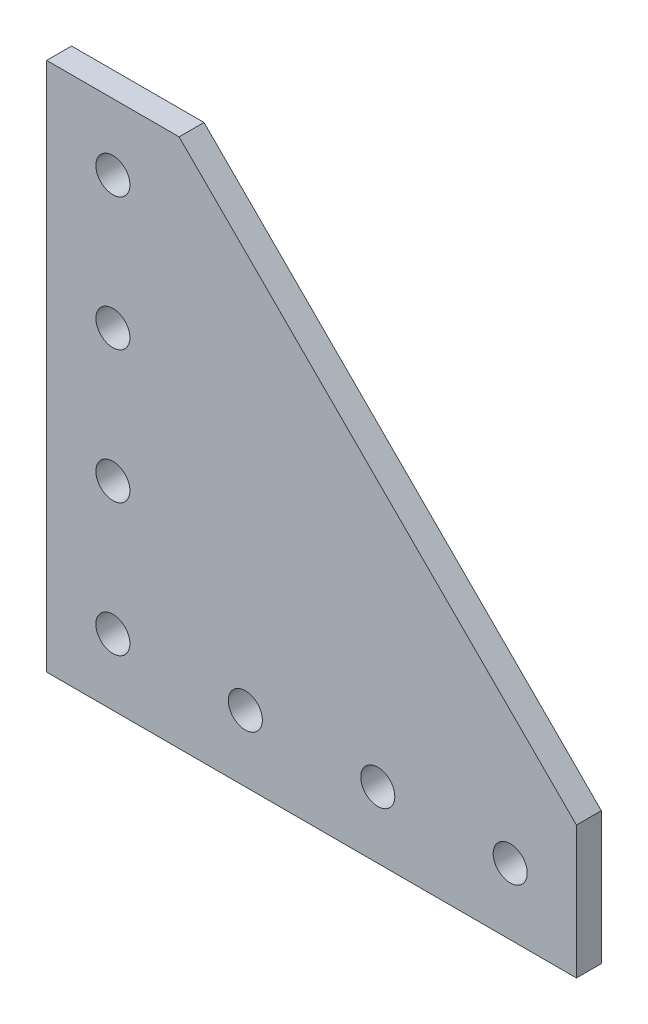
ISO-10303-21;
HEADER;
FILE_DESCRIPTION(('STEP AP214'),'2;1');
FILE_NAME('part.step','',(''),(''),'','','');
FILE_SCHEMA(('AUTOMOTIVE_DESIGN { 1 0 10303 214 1 1 1 1 }'));
ENDSEC;
DATA;
#1=APPLICATION_CONTEXT('core data for automotive mechanical design processes');
#2=APPLICATION_PROTOCOL_DEFINITION('international standard','automotive_design',2000,#1);
#3=PRODUCT_CONTEXT('',#1,'mechanical');
#4=PRODUCT('Part','Part','',(#3));
#5=PRODUCT_RELATED_PRODUCT_CATEGORY('part','',(#4));
#6=PRODUCT_DEFINITION_FORMATION('','',#4);
#7=PRODUCT_DEFINITION_CONTEXT('part definition',#1,'design');
#8=PRODUCT_DEFINITION('design','',#6,#7);
#9=PRODUCT_DEFINITION_SHAPE('','',#8);
#10=(LENGTH_UNIT() NAMED_UNIT(*) SI_UNIT(.MILLI.,.METRE.));
#11=(NAMED_UNIT(*) PLANE_ANGLE_UNIT() SI_UNIT($,.RADIAN.));
#12=(NAMED_UNIT(*) SI_UNIT($,.STERADIAN.) SOLID_ANGLE_UNIT());
#13=UNCERTAINTY_MEASURE_WITH_UNIT(LENGTH_MEASURE(1.E-05),#10,'distance_accuracy_value','');
#14=(GEOMETRIC_REPRESENTATION_CONTEXT(3) GLOBAL_UNCERTAINTY_ASSIGNED_CONTEXT((#13)) GLOBAL_UNIT_ASSIGNED_CONTEXT((#10,
#11,#12)) REPRESENTATION_CONTEXT('',''));
#15=CARTESIAN_POINT('',(0.,0.,0.));
#16=DIRECTION('',(0.,0.,1.));
#17=DIRECTION('',(1.,0.,0.));
#18=AXIS2_PLACEMENT_3D('',#15,#16,#17);
#19=CARTESIAN_POINT('',(-25.4,50.8,-2.3876));
#20=DIRECTION('',(0.707106781186547,0.707106781186547,0.));
#21=DIRECTION('',(-0.707106781186548,0.707106781186548,0.));
#22=AXIS2_PLACEMENT_3D('',#19,#20,#21);
#23=PLANE('',#22);
#24=DIRECTION('',(0.,0.,1.));
#25=VECTOR('',#24,1.);
#26=CARTESIAN_POINT('',(-25.4,50.8,-2.3876));
#27=LINE('',#26,#25);
#28=CARTESIAN_POINT('',(-25.4,50.8,-2.3876));
#29=VERTEX_POINT('',#28);
#30=CARTESIAN_POINT('',(-25.4,50.8,2.3876));
#31=VERTEX_POINT('',#30);
#32=EDGE_CURVE('E35',#29,#31,#27,.T.);
#33=ORIENTED_EDGE('',*,*,#32,.T.);
#34=DIRECTION('',(-0.707106781186548,0.707106781186548,0.));
#35=VECTOR('',#34,1.);
#36=CARTESIAN_POINT('',(-25.4,50.8,2.3876));
#37=LINE('',#36,#35);
#38=CARTESIAN_POINT('',(50.8,-25.4,2.3876));
#39=VERTEX_POINT('',#38);
#40=EDGE_CURVE('E78',#39,#31,#37,.T.);
#41=ORIENTED_EDGE('',*,*,#40,.F.);
#42=DIRECTION('',(0.,0.,1.));
#43=VECTOR('',#42,1.);
#44=CARTESIAN_POINT('',(50.8,-25.4,-2.3876));
#45=LINE('',#44,#43);
#46=CARTESIAN_POINT('',(50.8,-25.4,-2.3876));
#47=VERTEX_POINT('',#46);
#48=EDGE_CURVE('E11',#47,#39,#45,.T.);
#49=ORIENTED_EDGE('',*,*,#48,.F.);
#50=DIRECTION('',(-0.707106781186548,0.707106781186548,0.));
#51=VECTOR('',#50,1.);
#52=CARTESIAN_POINT('',(-25.4,50.8,-2.3876));
#53=LINE('',#52,#51);
#54=EDGE_CURVE('E79',#47,#29,#53,.T.);
#55=ORIENTED_EDGE('',*,*,#54,.T.);
#56=EDGE_LOOP('',(#33,#41,#49,#55));
#57=FACE_BOUND('',#56,.T.);
#58=ADVANCED_FACE('F32',(#57),#23,.T.);
#59=CARTESIAN_POINT('',(50.8,-25.4,-2.3876));
#60=DIRECTION('',(1.,0.,0.));
#61=DIRECTION('',(0.,1.,0.));
#62=AXIS2_PLACEMENT_3D('',#59,#60,#61);
#63=PLANE('',#62);
#64=ORIENTED_EDGE('',*,*,#48,.T.);
#65=DIRECTION('',(0.,1.,0.));
#66=VECTOR('',#65,1.);
#67=CARTESIAN_POINT('',(50.8,-25.4,2.3876));
#68=LINE('',#67,#66);
#69=CARTESIAN_POINT('',(50.8,-50.8,2.3876));
#70=VERTEX_POINT('',#69);
#71=EDGE_CURVE('E96',#70,#39,#68,.T.);
#72=ORIENTED_EDGE('',*,*,#71,.F.);
#73=DIRECTION('',(0.,0.,1.));
#74=VECTOR('',#73,1.);
#75=CARTESIAN_POINT('',(50.8,-50.8,-2.3876));
#76=LINE('',#75,#74);
#77=CARTESIAN_POINT('',(50.8,-50.8,-2.3876));
#78=VERTEX_POINT('',#77);
#79=EDGE_CURVE('E40',#78,#70,#76,.T.);
#80=ORIENTED_EDGE('',*,*,#79,.F.);
#81=DIRECTION('',(0.,1.,0.));
#82=VECTOR('',#81,1.);
#83=CARTESIAN_POINT('',(50.8,-25.4,-2.3876));
#84=LINE('',#83,#82);
#85=EDGE_CURVE('E84',#78,#47,#84,.T.);
#86=ORIENTED_EDGE('',*,*,#85,.T.);
#87=EDGE_LOOP('',(#64,#72,#80,#86));
#88=FACE_BOUND('',#87,.T.);
#89=ADVANCED_FACE('F129',(#88),#63,.T.);
#90=CARTESIAN_POINT('',(50.8,-50.8,-2.3876));
#91=DIRECTION('',(0.,-1.,0.));
#92=DIRECTION('',(0.,0.,-1.));
#93=AXIS2_PLACEMENT_3D('',#90,#91,#92);
#94=PLANE('',#93);
#95=ORIENTED_EDGE('',*,*,#79,.T.);
#96=DIRECTION('',(1.,0.,0.));
#97=VECTOR('',#96,1.);
#98=CARTESIAN_POINT('',(50.8,-50.8,2.3876));
#99=LINE('',#98,#97);
#100=CARTESIAN_POINT('',(-50.8,-50.8,2.3876));
#101=VERTEX_POINT('',#100);
#102=EDGE_CURVE('E105',#101,#70,#99,.T.);
#103=ORIENTED_EDGE('',*,*,#102,.F.);
#104=DIRECTION('',(0.,0.,1.));
#105=VECTOR('',#104,1.);
#106=CARTESIAN_POINT('',(-50.8,-50.8,-2.3876));
#107=LINE('',#106,#105);
#108=CARTESIAN_POINT('',(-50.8,-50.8,-2.3876));
#109=VERTEX_POINT('',#108);
#110=EDGE_CURVE('E118',#109,#101,#107,.T.);
#111=ORIENTED_EDGE('',*,*,#110,.F.);
#112=DIRECTION('',(1.,0.,0.));
#113=VECTOR('',#112,1.);
#114=CARTESIAN_POINT('',(50.8,-50.8,-2.3876));
#115=LINE('',#114,#113);
#116=EDGE_CURVE('E114',#109,#78,#115,.T.);
#117=ORIENTED_EDGE('',*,*,#116,.T.);
#118=EDGE_LOOP('',(#95,#103,#111,#117));
#119=FACE_BOUND('',#118,.T.);
#120=ADVANCED_FACE('F125',(#119),#94,.T.);
#121=CARTESIAN_POINT('',(-50.8,-50.8,-2.3876));
#122=DIRECTION('',(-1.,0.,0.));
#123=DIRECTION('',(0.,-1.,0.));
#124=AXIS2_PLACEMENT_3D('',#121,#122,#123);
#125=PLANE('',#124);
#126=ORIENTED_EDGE('',*,*,#110,.T.);
#127=DIRECTION('',(0.,-1.,0.));
#128=VECTOR('',#127,1.);
#129=CARTESIAN_POINT('',(-50.8,-50.8,2.3876));
#130=LINE('',#129,#128);
#131=CARTESIAN_POINT('',(-50.8,50.8,2.3876));
#132=VERTEX_POINT('',#131);
#133=EDGE_CURVE('E91',#132,#101,#130,.T.);
#134=ORIENTED_EDGE('',*,*,#133,.F.);
#135=DIRECTION('',(0.,0.,1.));
#136=VECTOR('',#135,1.);
#137=CARTESIAN_POINT('',(-50.8,50.8,-2.3876));
#138=LINE('',#137,#136);
#139=CARTESIAN_POINT('',(-50.8,50.8,-2.3876));
#140=VERTEX_POINT('',#139);
#141=EDGE_CURVE('E83',#140,#132,#138,.T.);
#142=ORIENTED_EDGE('',*,*,#141,.F.);
#143=DIRECTION('',(0.,-1.,0.));
#144=VECTOR('',#143,1.);
#145=CARTESIAN_POINT('',(-50.8,-50.8,-2.3876));
#146=LINE('',#145,#144);
#147=EDGE_CURVE('E111',#140,#109,#146,.T.);
#148=ORIENTED_EDGE('',*,*,#147,.T.);
#149=EDGE_LOOP('',(#126,#134,#142,#148));
#150=FACE_BOUND('',#149,.T.);
#151=ADVANCED_FACE('F120',(#150),#125,.T.);
#152=CARTESIAN_POINT('',(-50.8,50.8,-2.3876));
#153=DIRECTION('',(0.,1.,0.));
#154=DIRECTION('',(0.,0.,1.));
#155=AXIS2_PLACEMENT_3D('',#152,#153,#154);
#156=PLANE('',#155);
#157=ORIENTED_EDGE('',*,*,#141,.T.);
#158=DIRECTION('',(-1.,0.,0.));
#159=VECTOR('',#158,1.);
#160=CARTESIAN_POINT('',(-50.8,50.8,2.3876));
#161=LINE('',#160,#159);
#162=EDGE_CURVE('E86',#31,#132,#161,.T.);
#163=ORIENTED_EDGE('',*,*,#162,.F.);
#164=ORIENTED_EDGE('',*,*,#32,.F.);
#165=DIRECTION('',(-1.,0.,0.));
#166=VECTOR('',#165,1.);
#167=CARTESIAN_POINT('',(-50.8,50.8,-2.3876));
#168=LINE('',#167,#166);
#169=EDGE_CURVE('E109',#29,#140,#168,.T.);
#170=ORIENTED_EDGE('',*,*,#169,.T.);
#171=EDGE_LOOP('',(#157,#163,#164,#170));
#172=FACE_BOUND('',#171,.T.);
#173=ADVANCED_FACE('F87',(#172),#156,.T.);
#174=CARTESIAN_POINT('',(0.,0.,-2.3876));
#175=DIRECTION('',(0.,0.,-1.));
#176=DIRECTION('',(-1.,0.,0.));
#177=AXIS2_PLACEMENT_3D('',#174,#175,#176);
#178=PLANE('',#177);
#179=CARTESIAN_POINT('',(-12.7,-38.1,-2.3876));
#180=DIRECTION('',(0.,0.,1.));
#181=DIRECTION('',(1.,0.,0.));
#182=AXIS2_PLACEMENT_3D('',#179,#180,#181);
#183=CIRCLE('',#182,3.2639);
#184=CARTESIAN_POINT('',(-9.43609999999999,-38.1,-2.3876));
#185=VERTEX_POINT('',#184);
#186=EDGE_CURVE('E154',#185,#185,#183,.T.);
#187=ORIENTED_EDGE('',*,*,#186,.T.);
#188=EDGE_LOOP('',(#187));
#189=FACE_BOUND('',#188,.T.);
#190=CARTESIAN_POINT('',(12.7,-38.1,-2.3876));
#191=DIRECTION('',(0.,0.,1.));
#192=DIRECTION('',(1.,0.,0.));
#193=AXIS2_PLACEMENT_3D('',#190,#191,#192);
#194=CIRCLE('',#193,3.2639);
#195=CARTESIAN_POINT('',(15.9639,-38.1,-2.3876));
#196=VERTEX_POINT('',#195);
#197=EDGE_CURVE('E158',#196,#196,#194,.T.);
#198=ORIENTED_EDGE('',*,*,#197,.T.);
#199=EDGE_LOOP('',(#198));
#200=FACE_BOUND('',#199,.T.);
#201=CARTESIAN_POINT('',(-38.1000000000001,-12.7,-2.3876));
#202=DIRECTION('',(0.,0.,1.));
#203=DIRECTION('',(1.,0.,0.));
#204=AXIS2_PLACEMENT_3D('',#201,#202,#203);
#205=CIRCLE('',#204,3.2639);
#206=CARTESIAN_POINT('',(-34.8361000000001,-12.7,-2.3876));
#207=VERTEX_POINT('',#206);
#208=EDGE_CURVE('E162',#207,#207,#205,.T.);
#209=ORIENTED_EDGE('',*,*,#208,.T.);
#210=EDGE_LOOP('',(#209));
#211=FACE_BOUND('',#210,.T.);
#212=CARTESIAN_POINT('',(-38.1000000000002,12.7,-2.3876));
#213=DIRECTION('',(0.,0.,1.));
#214=DIRECTION('',(1.,0.,0.));
#215=AXIS2_PLACEMENT_3D('',#212,#213,#214);
#216=CIRCLE('',#215,3.2639);
#217=CARTESIAN_POINT('',(-34.8361000000002,12.7,-2.3876));
#218=VERTEX_POINT('',#217);
#219=EDGE_CURVE('E166',#218,#218,#216,.T.);
#220=ORIENTED_EDGE('',*,*,#219,.T.);
#221=EDGE_LOOP('',(#220));
#222=FACE_BOUND('',#221,.T.);
#223=CARTESIAN_POINT('',(38.1,-38.1,-2.3876));
#224=DIRECTION('',(0.,0.,1.));
#225=DIRECTION('',(1.,0.,0.));
#226=AXIS2_PLACEMENT_3D('',#223,#224,#225);
#227=CIRCLE('',#226,3.26389999999999);
#228=CARTESIAN_POINT('',(41.3639,-38.1,-2.3876));
#229=VERTEX_POINT('',#228);
#230=EDGE_CURVE('E170',#229,#229,#227,.T.);
#231=ORIENTED_EDGE('',*,*,#230,.T.);
#232=EDGE_LOOP('',(#231));
#233=FACE_BOUND('',#232,.T.);
#234=CARTESIAN_POINT('',(-38.1000000000003,38.1,-2.3876));
#235=DIRECTION('',(0.,0.,1.));
#236=DIRECTION('',(1.,0.,0.));
#237=AXIS2_PLACEMENT_3D('',#234,#235,#236);
#238=CIRCLE('',#237,3.2639);
#239=CARTESIAN_POINT('',(-34.8361000000003,38.1,-2.3876));
#240=VERTEX_POINT('',#239);
#241=EDGE_CURVE('E174',#240,#240,#238,.T.);
#242=ORIENTED_EDGE('',*,*,#241,.T.);
#243=EDGE_LOOP('',(#242));
#244=FACE_BOUND('',#243,.T.);
#245=CARTESIAN_POINT('',(-38.1,-38.1,-2.3876));
#246=DIRECTION('',(0.,0.,1.));
#247=DIRECTION('',(1.,0.,0.));
#248=AXIS2_PLACEMENT_3D('',#245,#246,#247);
#249=CIRCLE('',#248,3.2639);
#250=CARTESIAN_POINT('',(-34.8361,-38.1,-2.3876));
#251=VERTEX_POINT('',#250);
#252=EDGE_CURVE('E97',#251,#251,#249,.T.);
#253=ORIENTED_EDGE('',*,*,#252,.T.);
#254=EDGE_LOOP('',(#253));
#255=FACE_BOUND('',#254,.T.);
#256=ORIENTED_EDGE('',*,*,#54,.F.);
#257=ORIENTED_EDGE('',*,*,#85,.F.);
#258=ORIENTED_EDGE('',*,*,#116,.F.);
#259=ORIENTED_EDGE('',*,*,#147,.F.);
#260=ORIENTED_EDGE('',*,*,#169,.F.);
#261=EDGE_LOOP('',(#256,#257,#258,#259,#260));
#262=FACE_BOUND('',#261,.T.);
#263=ADVANCED_FACE('F128',(#189,#200,#211,#222,#233,#244,#255,#262),#178,.T.);
#264=CARTESIAN_POINT('',(0.,0.,2.3876));
#265=DIRECTION('',(0.,0.,-1.));
#266=DIRECTION('',(-1.,0.,0.));
#267=AXIS2_PLACEMENT_3D('',#264,#265,#266);
#268=PLANE('',#267);
#269=CARTESIAN_POINT('',(-12.7,-38.1,2.3876));
#270=DIRECTION('',(0.,0.,1.));
#271=DIRECTION('',(1.,0.,0.));
#272=AXIS2_PLACEMENT_3D('',#269,#270,#271);
#273=CIRCLE('',#272,3.2639);
#274=CARTESIAN_POINT('',(-9.43609999999999,-38.1,2.3876));
#275=VERTEX_POINT('',#274);
#276=EDGE_CURVE('E184',#275,#275,#273,.T.);
#277=ORIENTED_EDGE('',*,*,#276,.F.);
#278=EDGE_LOOP('',(#277));
#279=FACE_BOUND('',#278,.T.);
#280=CARTESIAN_POINT('',(12.7,-38.1,2.3876));
#281=DIRECTION('',(0.,0.,1.));
#282=DIRECTION('',(1.,0.,0.));
#283=AXIS2_PLACEMENT_3D('',#280,#281,#282);
#284=CIRCLE('',#283,3.2639);
#285=CARTESIAN_POINT('',(15.9639,-38.1,2.3876));
#286=VERTEX_POINT('',#285);
#287=EDGE_CURVE('E193',#286,#286,#284,.T.);
#288=ORIENTED_EDGE('',*,*,#287,.F.);
#289=EDGE_LOOP('',(#288));
#290=FACE_BOUND('',#289,.T.);
#291=CARTESIAN_POINT('',(-38.1000000000001,-12.7,2.3876));
#292=DIRECTION('',(0.,0.,1.));
#293=DIRECTION('',(1.,0.,0.));
#294=AXIS2_PLACEMENT_3D('',#291,#292,#293);
#295=CIRCLE('',#294,3.2639);
#296=CARTESIAN_POINT('',(-34.8361000000001,-12.7,2.3876));
#297=VERTEX_POINT('',#296);
#298=EDGE_CURVE('E197',#297,#297,#295,.T.);
#299=ORIENTED_EDGE('',*,*,#298,.F.);
#300=EDGE_LOOP('',(#299));
#301=FACE_BOUND('',#300,.T.);
#302=CARTESIAN_POINT('',(-38.1000000000002,12.7,2.3876));
#303=DIRECTION('',(0.,0.,1.));
#304=DIRECTION('',(1.,0.,0.));
#305=AXIS2_PLACEMENT_3D('',#302,#303,#304);
#306=CIRCLE('',#305,3.2639);
#307=CARTESIAN_POINT('',(-34.8361000000002,12.7,2.3876));
#308=VERTEX_POINT('',#307);
#309=EDGE_CURVE('E201',#308,#308,#306,.T.);
#310=ORIENTED_EDGE('',*,*,#309,.F.);
#311=EDGE_LOOP('',(#310));
#312=FACE_BOUND('',#311,.T.);
#313=CARTESIAN_POINT('',(38.1,-38.1,2.3876));
#314=DIRECTION('',(0.,0.,1.));
#315=DIRECTION('',(1.,0.,0.));
#316=AXIS2_PLACEMENT_3D('',#313,#314,#315);
#317=CIRCLE('',#316,3.26389999999999);
#318=CARTESIAN_POINT('',(41.3639,-38.1,2.3876));
#319=VERTEX_POINT('',#318);
#320=EDGE_CURVE('E205',#319,#319,#317,.T.);
#321=ORIENTED_EDGE('',*,*,#320,.F.);
#322=EDGE_LOOP('',(#321));
#323=FACE_BOUND('',#322,.T.);
#324=CARTESIAN_POINT('',(-38.1000000000003,38.1,2.3876));
#325=DIRECTION('',(0.,0.,1.));
#326=DIRECTION('',(1.,0.,0.));
#327=AXIS2_PLACEMENT_3D('',#324,#325,#326);
#328=CIRCLE('',#327,3.2639);
#329=CARTESIAN_POINT('',(-34.8361000000003,38.1,2.3876));
#330=VERTEX_POINT('',#329);
#331=EDGE_CURVE('E189',#330,#330,#328,.T.);
#332=ORIENTED_EDGE('',*,*,#331,.F.);
#333=EDGE_LOOP('',(#332));
#334=FACE_BOUND('',#333,.T.);
#335=CARTESIAN_POINT('',(-38.1,-38.1,2.3876));
#336=DIRECTION('',(0.,0.,1.));
#337=DIRECTION('',(1.,0.,0.));
#338=AXIS2_PLACEMENT_3D('',#335,#336,#337);
#339=CIRCLE('',#338,3.2639);
#340=CARTESIAN_POINT('',(-34.8361,-38.1,2.3876));
#341=VERTEX_POINT('',#340);
#342=EDGE_CURVE('E100',#341,#341,#339,.T.);
#343=ORIENTED_EDGE('',*,*,#342,.F.);
#344=EDGE_LOOP('',(#343));
#345=FACE_BOUND('',#344,.T.);
#346=ORIENTED_EDGE('',*,*,#40,.T.);
#347=ORIENTED_EDGE('',*,*,#162,.T.);
#348=ORIENTED_EDGE('',*,*,#133,.T.);
#349=ORIENTED_EDGE('',*,*,#102,.T.);
#350=ORIENTED_EDGE('',*,*,#71,.T.);
#351=EDGE_LOOP('',(#346,#347,#348,#349,#350));
#352=FACE_BOUND('',#351,.T.);
#353=ADVANCED_FACE('F94',(#279,#290,#301,#312,#323,#334,#345,#352),#268,.F.);
#354=CARTESIAN_POINT('',(-38.1,-38.1,-2.3876));
#355=DIRECTION('',(0.,0.,1.));
#356=DIRECTION('',(1.,0.,0.));
#357=AXIS2_PLACEMENT_3D('',#354,#355,#356);
#358=CYLINDRICAL_SURFACE('',#357,3.2639);
#359=ORIENTED_EDGE('',*,*,#252,.F.);
#360=EDGE_LOOP('',(#359));
#361=FACE_BOUND('',#360,.T.);
#362=ORIENTED_EDGE('',*,*,#342,.T.);
#363=EDGE_LOOP('',(#362));
#364=FACE_BOUND('',#363,.T.);
#365=ADVANCED_FACE('F149',(#361,#364),#358,.F.);
#366=CARTESIAN_POINT('',(-38.1000000000003,38.1,-2.3876));
#367=DIRECTION('',(0.,0.,1.));
#368=DIRECTION('',(1.,0.,0.));
#369=AXIS2_PLACEMENT_3D('',#366,#367,#368);
#370=CYLINDRICAL_SURFACE('',#369,3.2639);
#371=ORIENTED_EDGE('',*,*,#241,.F.);
#372=EDGE_LOOP('',(#371));
#373=FACE_BOUND('',#372,.T.);
#374=ORIENTED_EDGE('',*,*,#331,.T.);
#375=EDGE_LOOP('',(#374));
#376=FACE_BOUND('',#375,.T.);
#377=ADVANCED_FACE('F179',(#373,#376),#370,.F.);
#378=CARTESIAN_POINT('',(38.1,-38.1,-2.3876));
#379=DIRECTION('',(0.,0.,1.));
#380=DIRECTION('',(1.,0.,0.));
#381=AXIS2_PLACEMENT_3D('',#378,#379,#380);
#382=CYLINDRICAL_SURFACE('',#381,3.26389999999999);
#383=ORIENTED_EDGE('',*,*,#230,.F.);
#384=EDGE_LOOP('',(#383));
#385=FACE_BOUND('',#384,.T.);
#386=ORIENTED_EDGE('',*,*,#320,.T.);
#387=EDGE_LOOP('',(#386));
#388=FACE_BOUND('',#387,.T.);
#389=ADVANCED_FACE('F214',(#385,#388),#382,.F.);
#390=CARTESIAN_POINT('',(-38.1000000000002,12.7,-2.3876));
#391=DIRECTION('',(0.,0.,1.));
#392=DIRECTION('',(1.,0.,0.));
#393=AXIS2_PLACEMENT_3D('',#390,#391,#392);
#394=CYLINDRICAL_SURFACE('',#393,3.2639);
#395=ORIENTED_EDGE('',*,*,#219,.F.);
#396=EDGE_LOOP('',(#395));
#397=FACE_BOUND('',#396,.T.);
#398=ORIENTED_EDGE('',*,*,#309,.T.);
#399=EDGE_LOOP('',(#398));
#400=FACE_BOUND('',#399,.T.);
#401=ADVANCED_FACE('F220',(#397,#400),#394,.F.);
#402=CARTESIAN_POINT('',(-38.1000000000001,-12.7,-2.3876));
#403=DIRECTION('',(0.,0.,1.));
#404=DIRECTION('',(1.,0.,0.));
#405=AXIS2_PLACEMENT_3D('',#402,#403,#404);
#406=CYLINDRICAL_SURFACE('',#405,3.2639);
#407=ORIENTED_EDGE('',*,*,#208,.F.);
#408=EDGE_LOOP('',(#407));
#409=FACE_BOUND('',#408,.T.);
#410=ORIENTED_EDGE('',*,*,#298,.T.);
#411=EDGE_LOOP('',(#410));
#412=FACE_BOUND('',#411,.T.);
#413=ADVANCED_FACE('F231',(#409,#412),#406,.F.);
#414=CARTESIAN_POINT('',(12.7,-38.1,-2.3876));
#415=DIRECTION('',(0.,0.,1.));
#416=DIRECTION('',(1.,0.,0.));
#417=AXIS2_PLACEMENT_3D('',#414,#415,#416);
#418=CYLINDRICAL_SURFACE('',#417,3.2639);
#419=ORIENTED_EDGE('',*,*,#197,.F.);
#420=EDGE_LOOP('',(#419));
#421=FACE_BOUND('',#420,.T.);
#422=ORIENTED_EDGE('',*,*,#287,.T.);
#423=EDGE_LOOP('',(#422));
#424=FACE_BOUND('',#423,.T.);
#425=ADVANCED_FACE('F227',(#421,#424),#418,.F.);
#426=CARTESIAN_POINT('',(-12.7,-38.1,-2.3876));
#427=DIRECTION('',(0.,0.,1.));
#428=DIRECTION('',(1.,0.,0.));
#429=AXIS2_PLACEMENT_3D('',#426,#427,#428);
#430=CYLINDRICAL_SURFACE('',#429,3.2639);
#431=ORIENTED_EDGE('',*,*,#186,.F.);
#432=EDGE_LOOP('',(#431));
#433=FACE_BOUND('',#432,.T.);
#434=ORIENTED_EDGE('',*,*,#276,.T.);
#435=EDGE_LOOP('',(#434));
#436=FACE_BOUND('',#435,.T.);
#437=ADVANCED_FACE('F224',(#433,#436),#430,.F.);
#438=CLOSED_SHELL('',(#58,#89,#120,#151,#173,#263,#353,#365,#377,#389,#401,#413,#425,#437));
#439=MANIFOLD_SOLID_BREP('B2',#438);
#440=ADVANCED_BREP_SHAPE_REPRESENTATION('',(#18,#439),#14);
#441=SHAPE_DEFINITION_REPRESENTATION(#9,#440);
ENDSEC;
END-ISO-10303-21;
